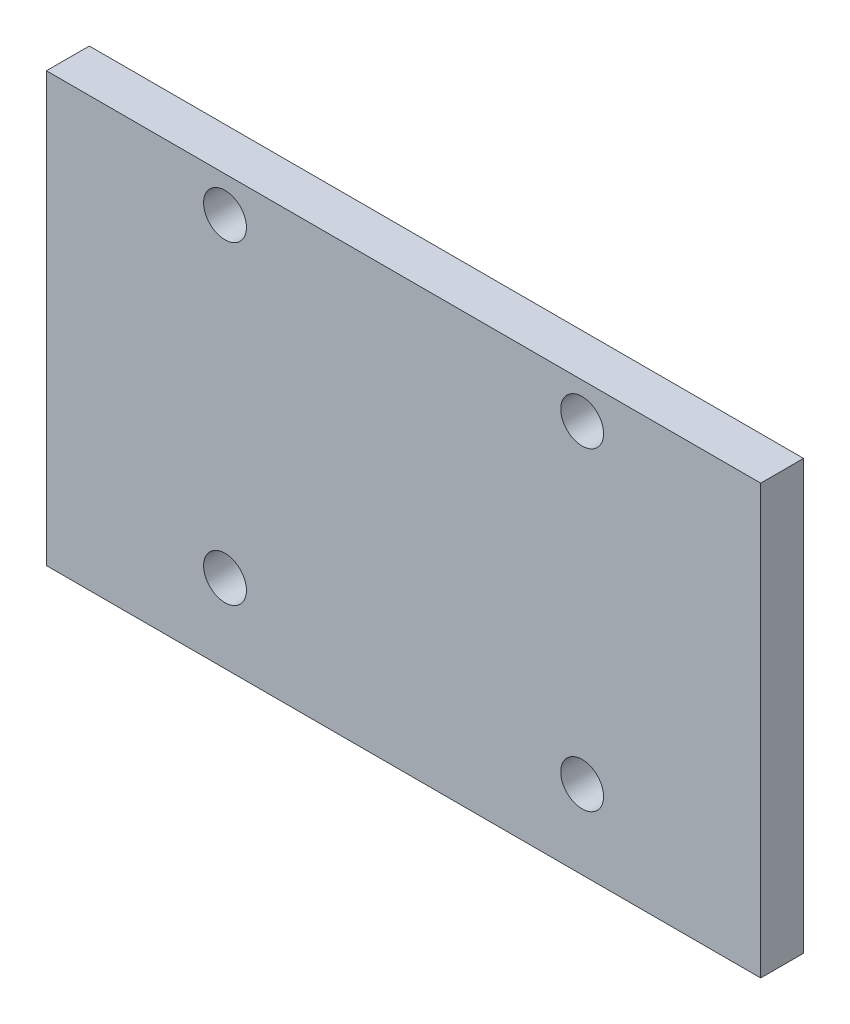
ISO-10303-21;
HEADER;
FILE_DESCRIPTION(('STEP AP214'),'2;1');
FILE_NAME('part.step','',(''),(''),'','','');
FILE_SCHEMA(('AUTOMOTIVE_DESIGN { 1 0 10303 214 1 1 1 1 }'));
ENDSEC;
DATA;
#1=APPLICATION_CONTEXT('core data for automotive mechanical design processes');
#2=APPLICATION_PROTOCOL_DEFINITION('international standard','automotive_design',2000,#1);
#3=PRODUCT_CONTEXT('',#1,'mechanical');
#4=PRODUCT('Part','Part','',(#3));
#5=PRODUCT_RELATED_PRODUCT_CATEGORY('part','',(#4));
#6=PRODUCT_DEFINITION_FORMATION('','',#4);
#7=PRODUCT_DEFINITION_CONTEXT('part definition',#1,'design');
#8=PRODUCT_DEFINITION('design','',#6,#7);
#9=PRODUCT_DEFINITION_SHAPE('','',#8);
#10=(LENGTH_UNIT() NAMED_UNIT(*) SI_UNIT(.MILLI.,.METRE.));
#11=(NAMED_UNIT(*) PLANE_ANGLE_UNIT() SI_UNIT($,.RADIAN.));
#12=(NAMED_UNIT(*) SI_UNIT($,.STERADIAN.) SOLID_ANGLE_UNIT());
#13=UNCERTAINTY_MEASURE_WITH_UNIT(LENGTH_MEASURE(1.E-05),#10,'distance_accuracy_value','');
#14=(GEOMETRIC_REPRESENTATION_CONTEXT(3) GLOBAL_UNCERTAINTY_ASSIGNED_CONTEXT((#13)) GLOBAL_UNIT_ASSIGNED_CONTEXT((#10,
#11,#12)) REPRESENTATION_CONTEXT('',''));
#15=CARTESIAN_POINT('',(0.,0.,0.));
#16=DIRECTION('',(0.,0.,1.));
#17=DIRECTION('',(1.,0.,0.));
#18=AXIS2_PLACEMENT_3D('',#15,#16,#17);
#19=CARTESIAN_POINT('',(0.,0.,3.));
#20=DIRECTION('',(0.,0.,1.));
#21=DIRECTION('',(1.,0.,0.));
#22=AXIS2_PLACEMENT_3D('',#19,#20,#21);
#23=PLANE('',#22);
#24=CARTESIAN_POINT('',(-18.3602150537634,-8.93575456255876,3.));
#25=DIRECTION('',(0.,0.,1.));
#26=DIRECTION('',(1.,0.,0.));
#27=AXIS2_PLACEMENT_3D('',#24,#25,#26);
#28=CIRCLE('',#27,1.5);
#29=CARTESIAN_POINT('',(-16.8602150537634,-8.93575456255876,3.));
#30=VERTEX_POINT('',#29);
#31=EDGE_CURVE('E142',#30,#30,#28,.T.);
#32=ORIENTED_EDGE('',*,*,#31,.F.);
#33=EDGE_LOOP('',(#32));
#34=FACE_BOUND('',#33,.T.);
#35=CARTESIAN_POINT('',(-18.3602150537634,13.0642454374412,3.));
#36=DIRECTION('',(0.,0.,1.));
#37=DIRECTION('',(1.,0.,0.));
#38=AXIS2_PLACEMENT_3D('',#35,#36,#37);
#39=CIRCLE('',#38,1.5);
#40=CARTESIAN_POINT('',(-16.8602150537634,13.0642454374412,3.));
#41=VERTEX_POINT('',#40);
#42=EDGE_CURVE('E112',#41,#41,#39,.T.);
#43=ORIENTED_EDGE('',*,*,#42,.F.);
#44=EDGE_LOOP('',(#43));
#45=FACE_BOUND('',#44,.T.);
#46=DIRECTION('',(0.,-1.,0.));
#47=VECTOR('',#46,1.);
#48=CARTESIAN_POINT('',(-30.8602150537634,15.5642454374412,3.));
#49=LINE('',#48,#47);
#50=CARTESIAN_POINT('',(-30.8602150537634,15.5642454374412,3.));
#51=VERTEX_POINT('',#50);
#52=CARTESIAN_POINT('',(-30.8602150537634,-14.4357545625588,3.));
#53=VERTEX_POINT('',#52);
#54=EDGE_CURVE('E92',#51,#53,#49,.T.);
#55=ORIENTED_EDGE('',*,*,#54,.T.);
#56=DIRECTION('',(1.,0.,0.));
#57=VECTOR('',#56,1.);
#58=CARTESIAN_POINT('',(-30.8602150537634,-14.4357545625588,3.));
#59=LINE('',#58,#57);
#60=CARTESIAN_POINT('',(19.1397849462366,-14.4357545625588,3.));
#61=VERTEX_POINT('',#60);
#62=EDGE_CURVE('E87',#53,#61,#59,.T.);
#63=ORIENTED_EDGE('',*,*,#62,.T.);
#64=DIRECTION('',(0.,1.,0.));
#65=VECTOR('',#64,1.);
#66=CARTESIAN_POINT('',(19.1397849462366,15.5642454374412,3.));
#67=LINE('',#66,#65);
#68=CARTESIAN_POINT('',(19.1397849462366,15.5642454374412,3.));
#69=VERTEX_POINT('',#68);
#70=EDGE_CURVE('E90',#61,#69,#67,.T.);
#71=ORIENTED_EDGE('',*,*,#70,.T.);
#72=DIRECTION('',(-1.,0.,0.));
#73=VECTOR('',#72,1.);
#74=CARTESIAN_POINT('',(-30.8602150537634,15.5642454374412,3.));
#75=LINE('',#74,#73);
#76=EDGE_CURVE('E57',#69,#51,#75,.T.);
#77=ORIENTED_EDGE('',*,*,#76,.T.);
#78=EDGE_LOOP('',(#55,#63,#71,#77));
#79=FACE_BOUND('',#78,.T.);
#80=CARTESIAN_POINT('',(6.63978494623656,13.0642454374412,3.));
#81=DIRECTION('',(0.,0.,1.));
#82=DIRECTION('',(1.,0.,0.));
#83=AXIS2_PLACEMENT_3D('',#80,#81,#82);
#84=CIRCLE('',#83,1.5);
#85=CARTESIAN_POINT('',(8.13978494623657,13.0642454374412,3.));
#86=VERTEX_POINT('',#85);
#87=EDGE_CURVE('E134',#86,#86,#84,.T.);
#88=ORIENTED_EDGE('',*,*,#87,.F.);
#89=EDGE_LOOP('',(#88));
#90=FACE_BOUND('',#89,.T.);
#91=CARTESIAN_POINT('',(6.63978494623656,-8.93575456255876,3.));
#92=DIRECTION('',(0.,0.,1.));
#93=DIRECTION('',(1.,0.,0.));
#94=AXIS2_PLACEMENT_3D('',#91,#92,#93);
#95=CIRCLE('',#94,1.5);
#96=CARTESIAN_POINT('',(8.13978494623656,-8.93575456255876,3.));
#97=VERTEX_POINT('',#96);
#98=EDGE_CURVE('E150',#97,#97,#95,.T.);
#99=ORIENTED_EDGE('',*,*,#98,.F.);
#100=EDGE_LOOP('',(#99));
#101=FACE_BOUND('',#100,.T.);
#102=ADVANCED_FACE('F39',(#34,#45,#79,#90,#101),#23,.T.);
#103=CARTESIAN_POINT('',(0.,0.,0.));
#104=DIRECTION('',(0.,0.,1.));
#105=DIRECTION('',(1.,0.,0.));
#106=AXIS2_PLACEMENT_3D('',#103,#104,#105);
#107=PLANE('',#106);
#108=DIRECTION('',(0.,-1.,0.));
#109=VECTOR('',#108,1.);
#110=CARTESIAN_POINT('',(-30.8602150537634,15.5642454374412,0.));
#111=LINE('',#110,#109);
#112=CARTESIAN_POINT('',(-30.8602150537634,15.5642454374412,0.));
#113=VERTEX_POINT('',#112);
#114=CARTESIAN_POINT('',(-30.8602150537634,-14.4357545625588,0.));
#115=VERTEX_POINT('',#114);
#116=EDGE_CURVE('E108',#113,#115,#111,.T.);
#117=ORIENTED_EDGE('',*,*,#116,.F.);
#118=DIRECTION('',(-1.,0.,0.));
#119=VECTOR('',#118,1.);
#120=CARTESIAN_POINT('',(-30.8602150537634,15.5642454374412,0.));
#121=LINE('',#120,#119);
#122=CARTESIAN_POINT('',(19.1397849462366,15.5642454374412,0.));
#123=VERTEX_POINT('',#122);
#124=EDGE_CURVE('E80',#123,#113,#121,.T.);
#125=ORIENTED_EDGE('',*,*,#124,.F.);
#126=DIRECTION('',(0.,1.,0.));
#127=VECTOR('',#126,1.);
#128=CARTESIAN_POINT('',(19.1397849462366,15.5642454374412,0.));
#129=LINE('',#128,#127);
#130=CARTESIAN_POINT('',(19.1397849462366,-14.4357545625588,0.));
#131=VERTEX_POINT('',#130);
#132=EDGE_CURVE('E74',#131,#123,#129,.T.);
#133=ORIENTED_EDGE('',*,*,#132,.F.);
#134=DIRECTION('',(1.,0.,0.));
#135=VECTOR('',#134,1.);
#136=CARTESIAN_POINT('',(-30.8602150537634,-14.4357545625588,0.));
#137=LINE('',#136,#135);
#138=EDGE_CURVE('E97',#115,#131,#137,.T.);
#139=ORIENTED_EDGE('',*,*,#138,.F.);
#140=EDGE_LOOP('',(#117,#125,#133,#139));
#141=FACE_BOUND('',#140,.T.);
#142=CARTESIAN_POINT('',(-18.3602150537634,13.0642454374412,0.));
#143=DIRECTION('',(0.,0.,1.));
#144=DIRECTION('',(1.,0.,0.));
#145=AXIS2_PLACEMENT_3D('',#142,#143,#144);
#146=CIRCLE('',#145,1.5);
#147=CARTESIAN_POINT('',(-16.8602150537634,13.0642454374412,0.));
#148=VERTEX_POINT('',#147);
#149=EDGE_CURVE('E130',#148,#148,#146,.T.);
#150=ORIENTED_EDGE('',*,*,#149,.T.);
#151=EDGE_LOOP('',(#150));
#152=FACE_BOUND('',#151,.T.);
#153=CARTESIAN_POINT('',(6.63978494623656,13.0642454374412,0.));
#154=DIRECTION('',(0.,0.,1.));
#155=DIRECTION('',(1.,0.,0.));
#156=AXIS2_PLACEMENT_3D('',#153,#154,#155);
#157=CIRCLE('',#156,1.5);
#158=CARTESIAN_POINT('',(8.13978494623657,13.0642454374412,0.));
#159=VERTEX_POINT('',#158);
#160=EDGE_CURVE('E138',#159,#159,#157,.T.);
#161=ORIENTED_EDGE('',*,*,#160,.T.);
#162=EDGE_LOOP('',(#161));
#163=FACE_BOUND('',#162,.T.);
#164=CARTESIAN_POINT('',(-18.3602150537634,-8.93575456255876,0.));
#165=DIRECTION('',(0.,0.,1.));
#166=DIRECTION('',(1.,0.,0.));
#167=AXIS2_PLACEMENT_3D('',#164,#165,#166);
#168=CIRCLE('',#167,1.5);
#169=CARTESIAN_POINT('',(-16.8602150537634,-8.93575456255876,0.));
#170=VERTEX_POINT('',#169);
#171=EDGE_CURVE('E146',#170,#170,#168,.T.);
#172=ORIENTED_EDGE('',*,*,#171,.T.);
#173=EDGE_LOOP('',(#172));
#174=FACE_BOUND('',#173,.T.);
#175=CARTESIAN_POINT('',(6.63978494623656,-8.93575456255876,0.));
#176=DIRECTION('',(0.,0.,1.));
#177=DIRECTION('',(1.,0.,0.));
#178=AXIS2_PLACEMENT_3D('',#175,#176,#177);
#179=CIRCLE('',#178,1.5);
#180=CARTESIAN_POINT('',(8.13978494623656,-8.93575456255876,0.));
#181=VERTEX_POINT('',#180);
#182=EDGE_CURVE('E154',#181,#181,#179,.T.);
#183=ORIENTED_EDGE('',*,*,#182,.T.);
#184=EDGE_LOOP('',(#183));
#185=FACE_BOUND('',#184,.T.);
#186=ADVANCED_FACE('F125',(#141,#152,#163,#174,#185),#107,.F.);
#187=CARTESIAN_POINT('',(-30.8602150537634,15.5642454374412,3.));
#188=DIRECTION('',(1.,0.,0.));
#189=DIRECTION('',(0.,1.,0.));
#190=AXIS2_PLACEMENT_3D('',#187,#188,#189);
#191=PLANE('',#190);
#192=ORIENTED_EDGE('',*,*,#116,.T.);
#193=DIRECTION('',(0.,0.,-1.));
#194=VECTOR('',#193,1.);
#195=CARTESIAN_POINT('',(-30.8602150537634,-14.4357545625588,3.));
#196=LINE('',#195,#194);
#197=EDGE_CURVE('E11',#53,#115,#196,.T.);
#198=ORIENTED_EDGE('',*,*,#197,.F.);
#199=ORIENTED_EDGE('',*,*,#54,.F.);
#200=DIRECTION('',(0.,0.,-1.));
#201=VECTOR('',#200,1.);
#202=CARTESIAN_POINT('',(-30.8602150537634,15.5642454374412,3.));
#203=LINE('',#202,#201);
#204=EDGE_CURVE('E104',#51,#113,#203,.T.);
#205=ORIENTED_EDGE('',*,*,#204,.T.);
#206=EDGE_LOOP('',(#192,#198,#199,#205));
#207=FACE_BOUND('',#206,.T.);
#208=ADVANCED_FACE('F41',(#207),#191,.F.);
#209=CARTESIAN_POINT('',(-30.8602150537634,-14.4357545625588,3.));
#210=DIRECTION('',(0.,1.,0.));
#211=DIRECTION('',(0.,0.,1.));
#212=AXIS2_PLACEMENT_3D('',#209,#210,#211);
#213=PLANE('',#212);
#214=ORIENTED_EDGE('',*,*,#138,.T.);
#215=DIRECTION('',(0.,0.,-1.));
#216=VECTOR('',#215,1.);
#217=CARTESIAN_POINT('',(19.1397849462366,-14.4357545625588,3.));
#218=LINE('',#217,#216);
#219=EDGE_CURVE('E49',#61,#131,#218,.T.);
#220=ORIENTED_EDGE('',*,*,#219,.F.);
#221=ORIENTED_EDGE('',*,*,#62,.F.);
#222=ORIENTED_EDGE('',*,*,#197,.T.);
#223=EDGE_LOOP('',(#214,#220,#221,#222));
#224=FACE_BOUND('',#223,.T.);
#225=ADVANCED_FACE('F96',(#224),#213,.F.);
#226=CARTESIAN_POINT('',(19.1397849462366,15.5642454374412,3.));
#227=DIRECTION('',(-1.,0.,0.));
#228=DIRECTION('',(0.,-1.,0.));
#229=AXIS2_PLACEMENT_3D('',#226,#227,#228);
#230=PLANE('',#229);
#231=ORIENTED_EDGE('',*,*,#132,.T.);
#232=DIRECTION('',(0.,0.,-1.));
#233=VECTOR('',#232,1.);
#234=CARTESIAN_POINT('',(19.1397849462366,15.5642454374412,3.));
#235=LINE('',#234,#233);
#236=EDGE_CURVE('E99',#69,#123,#235,.T.);
#237=ORIENTED_EDGE('',*,*,#236,.F.);
#238=ORIENTED_EDGE('',*,*,#70,.F.);
#239=ORIENTED_EDGE('',*,*,#219,.T.);
#240=EDGE_LOOP('',(#231,#237,#238,#239));
#241=FACE_BOUND('',#240,.T.);
#242=ADVANCED_FACE('F100',(#241),#230,.F.);
#243=CARTESIAN_POINT('',(-30.8602150537634,15.5642454374412,3.));
#244=DIRECTION('',(0.,-1.,0.));
#245=DIRECTION('',(0.,0.,-1.));
#246=AXIS2_PLACEMENT_3D('',#243,#244,#245);
#247=PLANE('',#246);
#248=ORIENTED_EDGE('',*,*,#124,.T.);
#249=ORIENTED_EDGE('',*,*,#204,.F.);
#250=ORIENTED_EDGE('',*,*,#76,.F.);
#251=ORIENTED_EDGE('',*,*,#236,.T.);
#252=EDGE_LOOP('',(#248,#249,#250,#251));
#253=FACE_BOUND('',#252,.T.);
#254=ADVANCED_FACE('F122',(#253),#247,.F.);
#255=CARTESIAN_POINT('',(-18.3602150537634,13.0642454374412,3.));
#256=DIRECTION('',(0.,0.,-1.));
#257=DIRECTION('',(-1.,0.,0.));
#258=AXIS2_PLACEMENT_3D('',#255,#256,#257);
#259=CYLINDRICAL_SURFACE('',#258,1.5);
#260=ORIENTED_EDGE('',*,*,#42,.T.);
#261=EDGE_LOOP('',(#260));
#262=FACE_BOUND('',#261,.T.);
#263=ORIENTED_EDGE('',*,*,#149,.F.);
#264=EDGE_LOOP('',(#263));
#265=FACE_BOUND('',#264,.T.);
#266=ADVANCED_FACE('F175',(#262,#265),#259,.F.);
#267=CARTESIAN_POINT('',(6.63978494623656,13.0642454374412,3.));
#268=DIRECTION('',(0.,0.,-1.));
#269=DIRECTION('',(-1.,0.,0.));
#270=AXIS2_PLACEMENT_3D('',#267,#268,#269);
#271=CYLINDRICAL_SURFACE('',#270,1.5);
#272=ORIENTED_EDGE('',*,*,#87,.T.);
#273=EDGE_LOOP('',(#272));
#274=FACE_BOUND('',#273,.T.);
#275=ORIENTED_EDGE('',*,*,#160,.F.);
#276=EDGE_LOOP('',(#275));
#277=FACE_BOUND('',#276,.T.);
#278=ADVANCED_FACE('F221',(#274,#277),#271,.F.);
#279=CARTESIAN_POINT('',(-18.3602150537634,-8.93575456255876,3.));
#280=DIRECTION('',(0.,0.,-1.));
#281=DIRECTION('',(-1.,0.,0.));
#282=AXIS2_PLACEMENT_3D('',#279,#280,#281);
#283=CYLINDRICAL_SURFACE('',#282,1.5);
#284=ORIENTED_EDGE('',*,*,#31,.T.);
#285=EDGE_LOOP('',(#284));
#286=FACE_BOUND('',#285,.T.);
#287=ORIENTED_EDGE('',*,*,#171,.F.);
#288=EDGE_LOOP('',(#287));
#289=FACE_BOUND('',#288,.T.);
#290=ADVANCED_FACE('F229',(#286,#289),#283,.F.);
#291=CARTESIAN_POINT('',(6.63978494623656,-8.93575456255876,3.));
#292=DIRECTION('',(0.,0.,-1.));
#293=DIRECTION('',(-1.,0.,0.));
#294=AXIS2_PLACEMENT_3D('',#291,#292,#293);
#295=CYLINDRICAL_SURFACE('',#294,1.5);
#296=ORIENTED_EDGE('',*,*,#98,.T.);
#297=EDGE_LOOP('',(#296));
#298=FACE_BOUND('',#297,.T.);
#299=ORIENTED_EDGE('',*,*,#182,.F.);
#300=EDGE_LOOP('',(#299));
#301=FACE_BOUND('',#300,.T.);
#302=ADVANCED_FACE('F162',(#298,#301),#295,.F.);
#303=CLOSED_SHELL('',(#102,#186,#208,#225,#242,#254,#266,#278,#290,#302));
#304=MANIFOLD_SOLID_BREP('B2',#303);
#305=ADVANCED_BREP_SHAPE_REPRESENTATION('',(#18,#304),#14);
#306=SHAPE_DEFINITION_REPRESENTATION(#9,#305);
ENDSEC;
END-ISO-10303-21;
